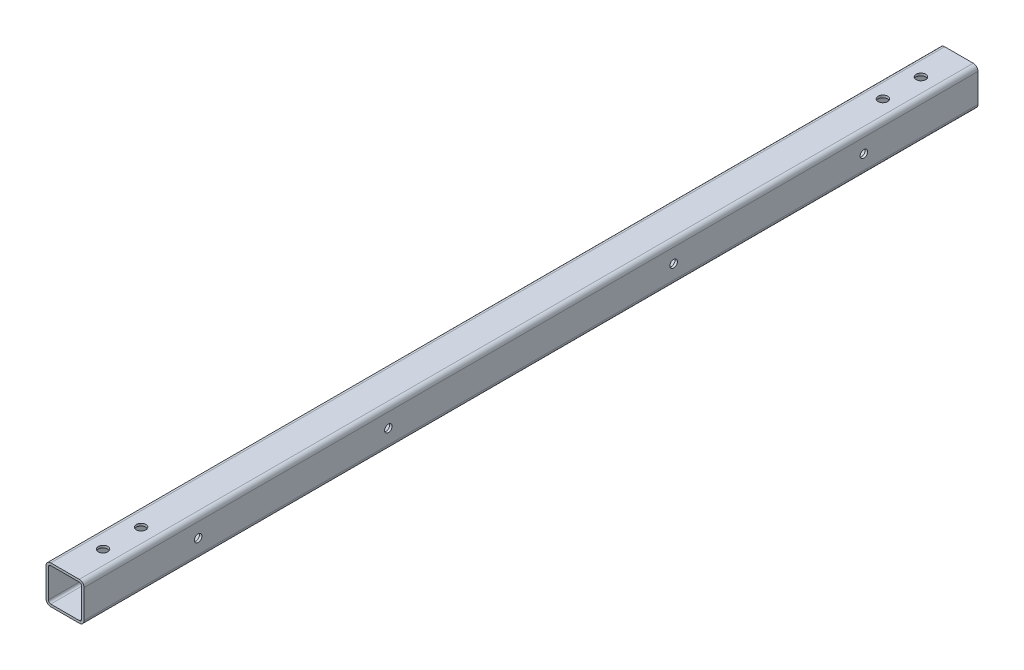
ISO-10303-21;
HEADER;
FILE_DESCRIPTION(('STEP AP214'),'2;1');
FILE_NAME('part.step','',(''),(''),'','','');
FILE_SCHEMA(('AUTOMOTIVE_DESIGN { 1 0 10303 214 1 1 1 1 }'));
ENDSEC;
DATA;
#1=APPLICATION_CONTEXT('core data for automotive mechanical design processes');
#2=APPLICATION_PROTOCOL_DEFINITION('international standard','automotive_design',2000,#1);
#3=PRODUCT_CONTEXT('',#1,'mechanical');
#4=PRODUCT('Part','Part','',(#3));
#5=PRODUCT_RELATED_PRODUCT_CATEGORY('part','',(#4));
#6=PRODUCT_DEFINITION_FORMATION('','',#4);
#7=PRODUCT_DEFINITION_CONTEXT('part definition',#1,'design');
#8=PRODUCT_DEFINITION('design','',#6,#7);
#9=PRODUCT_DEFINITION_SHAPE('','',#8);
#10=(LENGTH_UNIT() NAMED_UNIT(*) SI_UNIT(.MILLI.,.METRE.));
#11=(NAMED_UNIT(*) PLANE_ANGLE_UNIT() SI_UNIT($,.RADIAN.));
#12=(NAMED_UNIT(*) SI_UNIT($,.STERADIAN.) SOLID_ANGLE_UNIT());
#13=UNCERTAINTY_MEASURE_WITH_UNIT(LENGTH_MEASURE(1.E-05),#10,'distance_accuracy_value','');
#14=(GEOMETRIC_REPRESENTATION_CONTEXT(3) GLOBAL_UNCERTAINTY_ASSIGNED_CONTEXT((#13)) GLOBAL_UNIT_ASSIGNED_CONTEXT((#10,
#11,#12)) REPRESENTATION_CONTEXT('',''));
#15=CARTESIAN_POINT('',(0.,0.,0.));
#16=DIRECTION('',(0.,0.,1.));
#17=DIRECTION('',(1.,0.,0.));
#18=AXIS2_PLACEMENT_3D('',#15,#16,#17);
#19=CARTESIAN_POINT('',(-12.7,-12.7,-298.45));
#20=DIRECTION('',(0.,0.,-1.));
#21=DIRECTION('',(-1.,0.,0.));
#22=AXIS2_PLACEMENT_3D('',#19,#20,#21);
#23=PLANE('',#22);
#24=DIRECTION('',(0.,-1.,0.));
#25=VECTOR('',#24,1.);
#26=CARTESIAN_POINT('',(-12.7,12.7,-298.45));
#27=LINE('',#26,#25);
#28=CARTESIAN_POINT('',(-12.7,9.525,-298.45));
#29=VERTEX_POINT('',#28);
#30=CARTESIAN_POINT('',(-12.7,-9.525,-298.45));
#31=VERTEX_POINT('',#30);
#32=EDGE_CURVE('E239',#29,#31,#27,.T.);
#33=ORIENTED_EDGE('',*,*,#32,.F.);
#34=CARTESIAN_POINT('',(-9.525,9.525,-298.45));
#35=DIRECTION('',(0.,0.,-1.));
#36=DIRECTION('',(-1.,0.,0.));
#37=AXIS2_PLACEMENT_3D('',#34,#35,#36);
#38=CIRCLE('',#37,3.175);
#39=CARTESIAN_POINT('',(-9.525,12.7,-298.45));
#40=VERTEX_POINT('',#39);
#41=EDGE_CURVE('E265',#29,#40,#38,.T.);
#42=ORIENTED_EDGE('',*,*,#41,.T.);
#43=DIRECTION('',(1.,0.,0.));
#44=VECTOR('',#43,1.);
#45=CARTESIAN_POINT('',(-12.7,12.7,-298.45));
#46=LINE('',#45,#44);
#47=CARTESIAN_POINT('',(9.525,12.7,-298.45));
#48=VERTEX_POINT('',#47);
#49=EDGE_CURVE('E226',#40,#48,#46,.T.);
#50=ORIENTED_EDGE('',*,*,#49,.T.);
#51=CARTESIAN_POINT('',(9.525,9.525,-298.45));
#52=DIRECTION('',(0.,0.,-1.));
#53=DIRECTION('',(-1.,0.,0.));
#54=AXIS2_PLACEMENT_3D('',#51,#52,#53);
#55=CIRCLE('',#54,3.175);
#56=CARTESIAN_POINT('',(12.7,9.525,-298.45));
#57=VERTEX_POINT('',#56);
#58=EDGE_CURVE('E261',#48,#57,#55,.T.);
#59=ORIENTED_EDGE('',*,*,#58,.T.);
#60=DIRECTION('',(0.,1.,0.));
#61=VECTOR('',#60,1.);
#62=CARTESIAN_POINT('',(12.7,-12.7,-298.45));
#63=LINE('',#62,#61);
#64=CARTESIAN_POINT('',(12.7,-9.525,-298.45));
#65=VERTEX_POINT('',#64);
#66=EDGE_CURVE('E247',#65,#57,#63,.T.);
#67=ORIENTED_EDGE('',*,*,#66,.F.);
#68=CARTESIAN_POINT('',(9.525,-9.525,-298.45));
#69=DIRECTION('',(0.,0.,-1.));
#70=DIRECTION('',(-1.,0.,0.));
#71=AXIS2_PLACEMENT_3D('',#68,#69,#70);
#72=CIRCLE('',#71,3.175);
#73=CARTESIAN_POINT('',(9.525,-12.7,-298.45));
#74=VERTEX_POINT('',#73);
#75=EDGE_CURVE('E259',#65,#74,#72,.T.);
#76=ORIENTED_EDGE('',*,*,#75,.T.);
#77=DIRECTION('',(-1.,0.,0.));
#78=VECTOR('',#77,1.);
#79=CARTESIAN_POINT('',(12.7,-12.7,-298.45));
#80=LINE('',#79,#78);
#81=CARTESIAN_POINT('',(-9.52499999999999,-12.7,-298.45));
#82=VERTEX_POINT('',#81);
#83=EDGE_CURVE('E243',#74,#82,#80,.T.);
#84=ORIENTED_EDGE('',*,*,#83,.T.);
#85=CARTESIAN_POINT('',(-9.52499999999999,-9.525,-298.45));
#86=DIRECTION('',(0.,0.,-1.));
#87=DIRECTION('',(-1.,0.,0.));
#88=AXIS2_PLACEMENT_3D('',#85,#86,#87);
#89=CIRCLE('',#88,3.175);
#90=EDGE_CURVE('E263',#82,#31,#89,.T.);
#91=ORIENTED_EDGE('',*,*,#90,.T.);
#92=EDGE_LOOP('',(#33,#42,#50,#59,#67,#76,#84,#91));
#93=FACE_BOUND('',#92,.T.);
#94=CARTESIAN_POINT('',(-9.525,9.525,-298.45));
#95=DIRECTION('',(0.,0.,-1.));
#96=DIRECTION('',(-1.,0.,0.));
#97=AXIS2_PLACEMENT_3D('',#94,#95,#96);
#98=CIRCLE('',#97,1.5875);
#99=CARTESIAN_POINT('',(-11.1125,9.525,-298.45));
#100=VERTEX_POINT('',#99);
#101=CARTESIAN_POINT('',(-9.525,11.1125,-298.45));
#102=VERTEX_POINT('',#101);
#103=EDGE_CURVE('E207',#100,#102,#98,.T.);
#104=ORIENTED_EDGE('',*,*,#103,.F.);
#105=DIRECTION('',(0.,-1.,0.));
#106=VECTOR('',#105,1.);
#107=CARTESIAN_POINT('',(-11.1125,-12.7,-298.45));
#108=LINE('',#107,#106);
#109=CARTESIAN_POINT('',(-11.1125,-9.525,-298.45));
#110=VERTEX_POINT('',#109);
#111=EDGE_CURVE('E204',#100,#110,#108,.T.);
#112=ORIENTED_EDGE('',*,*,#111,.T.);
#113=CARTESIAN_POINT('',(-9.52499999999999,-9.525,-298.45));
#114=DIRECTION('',(0.,0.,-1.));
#115=DIRECTION('',(-1.,0.,0.));
#116=AXIS2_PLACEMENT_3D('',#113,#114,#115);
#117=CIRCLE('',#116,1.5875);
#118=CARTESIAN_POINT('',(-9.52499999999999,-11.1125,-298.45));
#119=VERTEX_POINT('',#118);
#120=EDGE_CURVE('E165',#119,#110,#117,.T.);
#121=ORIENTED_EDGE('',*,*,#120,.F.);
#122=DIRECTION('',(-1.,0.,0.));
#123=VECTOR('',#122,1.);
#124=CARTESIAN_POINT('',(-12.7,-11.1125,-298.45));
#125=LINE('',#124,#123);
#126=CARTESIAN_POINT('',(9.525,-11.1125,-298.45));
#127=VERTEX_POINT('',#126);
#128=EDGE_CURVE('E67',#127,#119,#125,.T.);
#129=ORIENTED_EDGE('',*,*,#128,.F.);
#130=CARTESIAN_POINT('',(9.525,-9.525,-298.45));
#131=DIRECTION('',(0.,0.,-1.));
#132=DIRECTION('',(-1.,0.,0.));
#133=AXIS2_PLACEMENT_3D('',#130,#131,#132);
#134=CIRCLE('',#133,1.5875);
#135=CARTESIAN_POINT('',(11.1125,-9.525,-298.45));
#136=VERTEX_POINT('',#135);
#137=EDGE_CURVE('E215',#136,#127,#134,.T.);
#138=ORIENTED_EDGE('',*,*,#137,.F.);
#139=DIRECTION('',(0.,1.,0.));
#140=VECTOR('',#139,1.);
#141=CARTESIAN_POINT('',(11.1125,-12.7,-298.45));
#142=LINE('',#141,#140);
#143=CARTESIAN_POINT('',(11.1125,9.525,-298.45));
#144=VERTEX_POINT('',#143);
#145=EDGE_CURVE('E212',#136,#144,#142,.T.);
#146=ORIENTED_EDGE('',*,*,#145,.T.);
#147=CARTESIAN_POINT('',(9.525,9.525,-298.45));
#148=DIRECTION('',(0.,0.,-1.));
#149=DIRECTION('',(-1.,0.,0.));
#150=AXIS2_PLACEMENT_3D('',#147,#148,#149);
#151=CIRCLE('',#150,1.5875);
#152=CARTESIAN_POINT('',(9.525,11.1125,-298.45));
#153=VERTEX_POINT('',#152);
#154=EDGE_CURVE('E213',#153,#144,#151,.T.);
#155=ORIENTED_EDGE('',*,*,#154,.F.);
#156=DIRECTION('',(1.,0.,0.));
#157=VECTOR('',#156,1.);
#158=CARTESIAN_POINT('',(-12.7,11.1125,-298.45));
#159=LINE('',#158,#157);
#160=EDGE_CURVE('E180',#102,#153,#159,.T.);
#161=ORIENTED_EDGE('',*,*,#160,.F.);
#162=EDGE_LOOP('',(#104,#112,#121,#129,#138,#146,#155,#161));
#163=FACE_BOUND('',#162,.T.);
#164=ADVANCED_FACE('F41',(#93,#163),#23,.T.);
#165=CARTESIAN_POINT('',(-12.7,12.7,298.45));
#166=DIRECTION('',(1.,0.,0.));
#167=DIRECTION('',(0.,1.,0.));
#168=AXIS2_PLACEMENT_3D('',#165,#166,#167);
#169=PLANE('',#168);
#170=DIRECTION('',(0.,-1.,0.));
#171=VECTOR('',#170,1.);
#172=CARTESIAN_POINT('',(-12.7,12.7,298.45));
#173=LINE('',#172,#171);
#174=CARTESIAN_POINT('',(-12.7,9.525,298.45));
#175=VERTEX_POINT('',#174);
#176=CARTESIAN_POINT('',(-12.7,-9.525,298.45));
#177=VERTEX_POINT('',#176);
#178=EDGE_CURVE('E222',#175,#177,#173,.T.);
#179=ORIENTED_EDGE('',*,*,#178,.F.);
#180=DIRECTION('',(0.,0.,-1.));
#181=VECTOR('',#180,1.);
#182=CARTESIAN_POINT('',(-12.7,9.525,-298.45));
#183=LINE('',#182,#181);
#184=EDGE_CURVE('E255',#175,#29,#183,.T.);
#185=ORIENTED_EDGE('',*,*,#184,.T.);
#186=ORIENTED_EDGE('',*,*,#32,.T.);
#187=DIRECTION('',(0.,0.,-1.));
#188=VECTOR('',#187,1.);
#189=CARTESIAN_POINT('',(-12.7,-9.525,298.45));
#190=LINE('',#189,#188);
#191=EDGE_CURVE('E238',#31,#177,#190,.F.);
#192=ORIENTED_EDGE('',*,*,#191,.T.);
#193=EDGE_LOOP('',(#179,#185,#186,#192));
#194=FACE_BOUND('',#193,.T.);
#195=ADVANCED_FACE('F384',(#194),#169,.F.);
#196=CARTESIAN_POINT('',(12.7,-12.7,298.45));
#197=DIRECTION('',(0.,-1.,0.));
#198=DIRECTION('',(1.,0.,0.));
#199=AXIS2_PLACEMENT_3D('',#196,#197,#198);
#200=PLANE('',#199);
#201=CARTESIAN_POINT('',(0.,-12.7,-273.05));
#202=DIRECTION('',(0.,-1.,0.));
#203=DIRECTION('',(1.,0.,0.));
#204=AXIS2_PLACEMENT_3D('',#201,#202,#203);
#205=CIRCLE('',#204,3.175);
#206=CARTESIAN_POINT('',(3.17500000000005,-12.7,-273.05));
#207=VERTEX_POINT('',#206);
#208=EDGE_CURVE('E659',#207,#207,#205,.T.);
#209=ORIENTED_EDGE('',*,*,#208,.F.);
#210=EDGE_LOOP('',(#209));
#211=FACE_BOUND('',#210,.T.);
#212=CARTESIAN_POINT('',(0.,-12.7,-247.65));
#213=DIRECTION('',(0.,-1.,0.));
#214=DIRECTION('',(1.,0.,0.));
#215=AXIS2_PLACEMENT_3D('',#212,#213,#214);
#216=CIRCLE('',#215,3.175);
#217=CARTESIAN_POINT('',(3.17500000000005,-12.7,-247.65));
#218=VERTEX_POINT('',#217);
#219=EDGE_CURVE('E310',#218,#218,#216,.T.);
#220=ORIENTED_EDGE('',*,*,#219,.F.);
#221=EDGE_LOOP('',(#220));
#222=FACE_BOUND('',#221,.T.);
#223=CARTESIAN_POINT('',(0.,-12.7,247.65));
#224=DIRECTION('',(0.,-1.,0.));
#225=DIRECTION('',(1.,0.,0.));
#226=AXIS2_PLACEMENT_3D('',#223,#224,#225);
#227=CIRCLE('',#226,3.175);
#228=CARTESIAN_POINT('',(3.17499999999998,-12.7,247.65));
#229=VERTEX_POINT('',#228);
#230=EDGE_CURVE('E307',#229,#229,#227,.T.);
#231=ORIENTED_EDGE('',*,*,#230,.F.);
#232=EDGE_LOOP('',(#231));
#233=FACE_BOUND('',#232,.T.);
#234=CARTESIAN_POINT('',(0.,-12.7,273.05));
#235=DIRECTION('',(0.,-1.,0.));
#236=DIRECTION('',(1.,0.,0.));
#237=AXIS2_PLACEMENT_3D('',#234,#235,#236);
#238=CIRCLE('',#237,3.17499999999999);
#239=CARTESIAN_POINT('',(3.17499999999997,-12.7,273.05));
#240=VERTEX_POINT('',#239);
#241=EDGE_CURVE('E326',#240,#240,#238,.T.);
#242=ORIENTED_EDGE('',*,*,#241,.F.);
#243=EDGE_LOOP('',(#242));
#244=FACE_BOUND('',#243,.T.);
#245=DIRECTION('',(-1.,0.,0.));
#246=VECTOR('',#245,1.);
#247=CARTESIAN_POINT('',(12.7,-12.7,298.45));
#248=LINE('',#247,#246);
#249=CARTESIAN_POINT('',(9.525,-12.7,298.45));
#250=VERTEX_POINT('',#249);
#251=CARTESIAN_POINT('',(-9.52499999999999,-12.7,298.45));
#252=VERTEX_POINT('',#251);
#253=EDGE_CURVE('E225',#250,#252,#248,.T.);
#254=ORIENTED_EDGE('',*,*,#253,.T.);
#255=DIRECTION('',(0.,0.,-1.));
#256=VECTOR('',#255,1.);
#257=CARTESIAN_POINT('',(-9.52499999999999,-12.7,-298.45));
#258=LINE('',#257,#256);
#259=EDGE_CURVE('E285',#252,#82,#258,.T.);
#260=ORIENTED_EDGE('',*,*,#259,.T.);
#261=ORIENTED_EDGE('',*,*,#83,.F.);
#262=DIRECTION('',(0.,0.,-1.));
#263=VECTOR('',#262,1.);
#264=CARTESIAN_POINT('',(9.525,-12.7,298.45));
#265=LINE('',#264,#263);
#266=EDGE_CURVE('E282',#74,#250,#265,.F.);
#267=ORIENTED_EDGE('',*,*,#266,.T.);
#268=EDGE_LOOP('',(#254,#260,#261,#267));
#269=FACE_BOUND('',#268,.T.);
#270=ADVANCED_FACE('F390',(#211,#222,#233,#244,#269),#200,.T.);
#271=CARTESIAN_POINT('',(12.7,-12.7,298.45));
#272=DIRECTION('',(-1.,0.,0.));
#273=DIRECTION('',(0.,0.,1.));
#274=AXIS2_PLACEMENT_3D('',#271,#272,#273);
#275=PLANE('',#274);
#276=CARTESIAN_POINT('',(12.7,0.,95.2500000000002));
#277=DIRECTION('',(-1.,0.,0.));
#278=DIRECTION('',(0.,0.,1.));
#279=AXIS2_PLACEMENT_3D('',#276,#277,#278);
#280=CIRCLE('',#279,2.49999999999999);
#281=CARTESIAN_POINT('',(12.7,0.,97.7500000000002));
#282=VERTEX_POINT('',#281);
#283=EDGE_CURVE('E681',#282,#282,#280,.F.);
#284=ORIENTED_EDGE('',*,*,#283,.F.);
#285=EDGE_LOOP('',(#284));
#286=FACE_BOUND('',#285,.T.);
#287=CARTESIAN_POINT('',(12.7,0.,222.25));
#288=DIRECTION('',(-1.,0.,0.));
#289=DIRECTION('',(0.,0.,1.));
#290=AXIS2_PLACEMENT_3D('',#287,#288,#289);
#291=CIRCLE('',#290,2.49999999999999);
#292=CARTESIAN_POINT('',(12.7,0.,224.75));
#293=VERTEX_POINT('',#292);
#294=EDGE_CURVE('E675',#293,#293,#291,.F.);
#295=ORIENTED_EDGE('',*,*,#294,.F.);
#296=EDGE_LOOP('',(#295));
#297=FACE_BOUND('',#296,.T.);
#298=CARTESIAN_POINT('',(12.7,0.,-222.25));
#299=DIRECTION('',(-1.,0.,0.));
#300=DIRECTION('',(0.,0.,1.));
#301=AXIS2_PLACEMENT_3D('',#298,#299,#300);
#302=CIRCLE('',#301,2.49999999999999);
#303=CARTESIAN_POINT('',(12.7,0.,-219.75));
#304=VERTEX_POINT('',#303);
#305=EDGE_CURVE('E669',#304,#304,#302,.F.);
#306=ORIENTED_EDGE('',*,*,#305,.F.);
#307=EDGE_LOOP('',(#306));
#308=FACE_BOUND('',#307,.T.);
#309=CARTESIAN_POINT('',(12.7,0.,-95.2499999999998));
#310=DIRECTION('',(-1.,0.,0.));
#311=DIRECTION('',(0.,0.,1.));
#312=AXIS2_PLACEMENT_3D('',#309,#310,#311);
#313=CIRCLE('',#312,2.49999999999999);
#314=CARTESIAN_POINT('',(12.7,0.,-92.7499999999998));
#315=VERTEX_POINT('',#314);
#316=EDGE_CURVE('E662',#315,#315,#313,.F.);
#317=ORIENTED_EDGE('',*,*,#316,.F.);
#318=EDGE_LOOP('',(#317));
#319=FACE_BOUND('',#318,.T.);
#320=ORIENTED_EDGE('',*,*,#66,.T.);
#321=DIRECTION('',(0.,0.,-1.));
#322=VECTOR('',#321,1.);
#323=CARTESIAN_POINT('',(12.7,9.525,298.45));
#324=LINE('',#323,#322);
#325=CARTESIAN_POINT('',(12.7,9.525,298.45));
#326=VERTEX_POINT('',#325);
#327=EDGE_CURVE('E11',#57,#326,#324,.F.);
#328=ORIENTED_EDGE('',*,*,#327,.T.);
#329=DIRECTION('',(0.,1.,0.));
#330=VECTOR('',#329,1.);
#331=CARTESIAN_POINT('',(12.7,-12.7,298.45));
#332=LINE('',#331,#330);
#333=CARTESIAN_POINT('',(12.7,-9.525,298.45));
#334=VERTEX_POINT('',#333);
#335=EDGE_CURVE('E230',#334,#326,#332,.T.);
#336=ORIENTED_EDGE('',*,*,#335,.F.);
#337=DIRECTION('',(0.,0.,-1.));
#338=VECTOR('',#337,1.);
#339=CARTESIAN_POINT('',(12.7,-9.525,-298.45));
#340=LINE('',#339,#338);
#341=EDGE_CURVE('E51',#334,#65,#340,.T.);
#342=ORIENTED_EDGE('',*,*,#341,.T.);
#343=EDGE_LOOP('',(#320,#328,#336,#342));
#344=FACE_BOUND('',#343,.T.);
#345=ADVANCED_FACE('F400',(#286,#297,#308,#319,#344),#275,.F.);
#346=CARTESIAN_POINT('',(-12.7,12.7,298.45));
#347=DIRECTION('',(0.,1.,0.));
#348=DIRECTION('',(-1.,0.,0.));
#349=AXIS2_PLACEMENT_3D('',#346,#347,#348);
#350=PLANE('',#349);
#351=CARTESIAN_POINT('',(0.,12.7,-273.05));
#352=DIRECTION('',(0.,-1.,0.));
#353=DIRECTION('',(1.,0.,0.));
#354=AXIS2_PLACEMENT_3D('',#351,#352,#353);
#355=CIRCLE('',#354,3.175);
#356=CARTESIAN_POINT('',(3.17500000000005,12.7,-273.05));
#357=VERTEX_POINT('',#356);
#358=EDGE_CURVE('E657',#357,#357,#355,.T.);
#359=ORIENTED_EDGE('',*,*,#358,.T.);
#360=EDGE_LOOP('',(#359));
#361=FACE_BOUND('',#360,.T.);
#362=CARTESIAN_POINT('',(0.,12.7,-247.65));
#363=DIRECTION('',(0.,-1.,0.));
#364=DIRECTION('',(1.,0.,0.));
#365=AXIS2_PLACEMENT_3D('',#362,#363,#364);
#366=CIRCLE('',#365,3.175);
#367=CARTESIAN_POINT('',(3.17500000000005,12.7,-247.65));
#368=VERTEX_POINT('',#367);
#369=EDGE_CURVE('E303',#368,#368,#366,.T.);
#370=ORIENTED_EDGE('',*,*,#369,.T.);
#371=EDGE_LOOP('',(#370));
#372=FACE_BOUND('',#371,.T.);
#373=CARTESIAN_POINT('',(0.,12.7,247.65));
#374=DIRECTION('',(0.,-1.,0.));
#375=DIRECTION('',(1.,0.,0.));
#376=AXIS2_PLACEMENT_3D('',#373,#374,#375);
#377=CIRCLE('',#376,3.175);
#378=CARTESIAN_POINT('',(3.17499999999999,12.7,247.65));
#379=VERTEX_POINT('',#378);
#380=EDGE_CURVE('E299',#379,#379,#377,.T.);
#381=ORIENTED_EDGE('',*,*,#380,.T.);
#382=EDGE_LOOP('',(#381));
#383=FACE_BOUND('',#382,.T.);
#384=CARTESIAN_POINT('',(0.,12.7,273.05));
#385=DIRECTION('',(0.,-1.,0.));
#386=DIRECTION('',(1.,0.,0.));
#387=AXIS2_PLACEMENT_3D('',#384,#385,#386);
#388=CIRCLE('',#387,3.17499999999999);
#389=CARTESIAN_POINT('',(3.17499999999997,12.7,273.05));
#390=VERTEX_POINT('',#389);
#391=EDGE_CURVE('E295',#390,#390,#388,.T.);
#392=ORIENTED_EDGE('',*,*,#391,.T.);
#393=EDGE_LOOP('',(#392));
#394=FACE_BOUND('',#393,.T.);
#395=ORIENTED_EDGE('',*,*,#49,.F.);
#396=DIRECTION('',(0.,0.,-1.));
#397=VECTOR('',#396,1.);
#398=CARTESIAN_POINT('',(-9.525,12.7,298.45));
#399=LINE('',#398,#397);
#400=CARTESIAN_POINT('',(-9.525,12.7,298.45));
#401=VERTEX_POINT('',#400);
#402=EDGE_CURVE('E271',#40,#401,#399,.F.);
#403=ORIENTED_EDGE('',*,*,#402,.T.);
#404=DIRECTION('',(1.,0.,0.));
#405=VECTOR('',#404,1.);
#406=CARTESIAN_POINT('',(-12.7,12.7,298.45));
#407=LINE('',#406,#405);
#408=CARTESIAN_POINT('',(9.525,12.7,298.45));
#409=VERTEX_POINT('',#408);
#410=EDGE_CURVE('E234',#401,#409,#407,.T.);
#411=ORIENTED_EDGE('',*,*,#410,.T.);
#412=DIRECTION('',(0.,0.,-1.));
#413=VECTOR('',#412,1.);
#414=CARTESIAN_POINT('',(9.525,12.7,-298.45));
#415=LINE('',#414,#413);
#416=EDGE_CURVE('E267',#409,#48,#415,.T.);
#417=ORIENTED_EDGE('',*,*,#416,.T.);
#418=EDGE_LOOP('',(#395,#403,#411,#417));
#419=FACE_BOUND('',#418,.T.);
#420=ADVANCED_FACE('F397',(#361,#372,#383,#394,#419),#350,.T.);
#421=CARTESIAN_POINT('',(-12.7,-12.7,298.45));
#422=DIRECTION('',(0.,0.,-1.));
#423=DIRECTION('',(-1.,0.,0.));
#424=AXIS2_PLACEMENT_3D('',#421,#422,#423);
#425=PLANE('',#424);
#426=CARTESIAN_POINT('',(-9.525,9.525,298.45));
#427=DIRECTION('',(0.,0.,-1.));
#428=DIRECTION('',(-1.,0.,0.));
#429=AXIS2_PLACEMENT_3D('',#426,#427,#428);
#430=CIRCLE('',#429,1.5875);
#431=CARTESIAN_POINT('',(-9.525,11.1125,298.45));
#432=VERTEX_POINT('',#431);
#433=CARTESIAN_POINT('',(-11.1125,9.525,298.45));
#434=VERTEX_POINT('',#433);
#435=EDGE_CURVE('E187',#432,#434,#430,.F.);
#436=ORIENTED_EDGE('',*,*,#435,.F.);
#437=DIRECTION('',(1.,0.,0.));
#438=VECTOR('',#437,1.);
#439=CARTESIAN_POINT('',(-12.7,11.1125,298.45));
#440=LINE('',#439,#438);
#441=CARTESIAN_POINT('',(9.525,11.1125,298.45));
#442=VERTEX_POINT('',#441);
#443=EDGE_CURVE('E171',#432,#442,#440,.T.);
#444=ORIENTED_EDGE('',*,*,#443,.T.);
#445=CARTESIAN_POINT('',(9.525,9.525,298.45));
#446=DIRECTION('',(0.,0.,-1.));
#447=DIRECTION('',(-1.,0.,0.));
#448=AXIS2_PLACEMENT_3D('',#445,#446,#447);
#449=CIRCLE('',#448,1.5875);
#450=CARTESIAN_POINT('',(11.1125,9.525,298.45));
#451=VERTEX_POINT('',#450);
#452=EDGE_CURVE('E188',#451,#442,#449,.F.);
#453=ORIENTED_EDGE('',*,*,#452,.F.);
#454=DIRECTION('',(0.,1.,0.));
#455=VECTOR('',#454,1.);
#456=CARTESIAN_POINT('',(11.1125,-12.7,298.45));
#457=LINE('',#456,#455);
#458=CARTESIAN_POINT('',(11.1125,-9.525,298.45));
#459=VERTEX_POINT('',#458);
#460=EDGE_CURVE('E59',#459,#451,#457,.T.);
#461=ORIENTED_EDGE('',*,*,#460,.F.);
#462=CARTESIAN_POINT('',(9.525,-9.525,298.45));
#463=DIRECTION('',(0.,0.,-1.));
#464=DIRECTION('',(-1.,0.,0.));
#465=AXIS2_PLACEMENT_3D('',#462,#463,#464);
#466=CIRCLE('',#465,1.5875);
#467=CARTESIAN_POINT('',(9.525,-11.1125,298.45));
#468=VERTEX_POINT('',#467);
#469=EDGE_CURVE('E192',#468,#459,#466,.F.);
#470=ORIENTED_EDGE('',*,*,#469,.F.);
#471=DIRECTION('',(-1.,0.,0.));
#472=VECTOR('',#471,1.);
#473=CARTESIAN_POINT('',(-12.7,-11.1125,298.45));
#474=LINE('',#473,#472);
#475=CARTESIAN_POINT('',(-9.52499999999999,-11.1125,298.45));
#476=VERTEX_POINT('',#475);
#477=EDGE_CURVE('E179',#468,#476,#474,.T.);
#478=ORIENTED_EDGE('',*,*,#477,.T.);
#479=CARTESIAN_POINT('',(-9.52499999999999,-9.525,298.45));
#480=DIRECTION('',(0.,0.,-1.));
#481=DIRECTION('',(-1.,0.,0.));
#482=AXIS2_PLACEMENT_3D('',#479,#480,#481);
#483=CIRCLE('',#482,1.5875);
#484=CARTESIAN_POINT('',(-11.1125,-9.525,298.45));
#485=VERTEX_POINT('',#484);
#486=EDGE_CURVE('E163',#485,#476,#483,.F.);
#487=ORIENTED_EDGE('',*,*,#486,.F.);
#488=DIRECTION('',(0.,-1.,0.));
#489=VECTOR('',#488,1.);
#490=CARTESIAN_POINT('',(-11.1125,-12.7,298.45));
#491=LINE('',#490,#489);
#492=EDGE_CURVE('E175',#434,#485,#491,.T.);
#493=ORIENTED_EDGE('',*,*,#492,.F.);
#494=EDGE_LOOP('',(#436,#444,#453,#461,#470,#478,#487,#493));
#495=FACE_BOUND('',#494,.T.);
#496=ORIENTED_EDGE('',*,*,#410,.F.);
#497=CARTESIAN_POINT('',(-9.525,9.525,298.45));
#498=DIRECTION('',(0.,0.,-1.));
#499=DIRECTION('',(-1.,0.,0.));
#500=AXIS2_PLACEMENT_3D('',#497,#498,#499);
#501=CIRCLE('',#500,3.175);
#502=EDGE_CURVE('E280',#401,#175,#501,.F.);
#503=ORIENTED_EDGE('',*,*,#502,.T.);
#504=ORIENTED_EDGE('',*,*,#178,.T.);
#505=CARTESIAN_POINT('',(-9.52499999999999,-9.525,298.45));
#506=DIRECTION('',(0.,0.,-1.));
#507=DIRECTION('',(-1.,0.,0.));
#508=AXIS2_PLACEMENT_3D('',#505,#506,#507);
#509=CIRCLE('',#508,3.175);
#510=EDGE_CURVE('E278',#177,#252,#509,.F.);
#511=ORIENTED_EDGE('',*,*,#510,.T.);
#512=ORIENTED_EDGE('',*,*,#253,.F.);
#513=CARTESIAN_POINT('',(9.525,-9.525,298.45));
#514=DIRECTION('',(0.,0.,-1.));
#515=DIRECTION('',(-1.,0.,0.));
#516=AXIS2_PLACEMENT_3D('',#513,#514,#515);
#517=CIRCLE('',#516,3.175);
#518=EDGE_CURVE('E274',#250,#334,#517,.F.);
#519=ORIENTED_EDGE('',*,*,#518,.T.);
#520=ORIENTED_EDGE('',*,*,#335,.T.);
#521=CARTESIAN_POINT('',(9.525,9.525,298.45));
#522=DIRECTION('',(0.,0.,-1.));
#523=DIRECTION('',(-1.,0.,0.));
#524=AXIS2_PLACEMENT_3D('',#521,#522,#523);
#525=CIRCLE('',#524,3.175);
#526=EDGE_CURVE('E276',#326,#409,#525,.F.);
#527=ORIENTED_EDGE('',*,*,#526,.T.);
#528=EDGE_LOOP('',(#496,#503,#504,#511,#512,#519,#520,#527));
#529=FACE_BOUND('',#528,.T.);
#530=ADVANCED_FACE('F183',(#495,#529),#425,.F.);
#531=CARTESIAN_POINT('',(-9.525,9.525,298.45));
#532=DIRECTION('',(0.,0.,1.));
#533=DIRECTION('',(1.,0.,0.));
#534=AXIS2_PLACEMENT_3D('',#531,#532,#533);
#535=CYLINDRICAL_SURFACE('',#534,3.175);
#536=ORIENTED_EDGE('',*,*,#502,.F.);
#537=ORIENTED_EDGE('',*,*,#402,.F.);
#538=ORIENTED_EDGE('',*,*,#41,.F.);
#539=ORIENTED_EDGE('',*,*,#184,.F.);
#540=EDGE_LOOP('',(#536,#537,#538,#539));
#541=FACE_BOUND('',#540,.T.);
#542=ADVANCED_FACE('F407',(#541),#535,.T.);
#543=CARTESIAN_POINT('',(-9.52499999999999,-9.525,298.45));
#544=DIRECTION('',(0.,0.,1.));
#545=DIRECTION('',(1.,0.,0.));
#546=AXIS2_PLACEMENT_3D('',#543,#544,#545);
#547=CYLINDRICAL_SURFACE('',#546,3.175);
#548=ORIENTED_EDGE('',*,*,#510,.F.);
#549=ORIENTED_EDGE('',*,*,#191,.F.);
#550=ORIENTED_EDGE('',*,*,#90,.F.);
#551=ORIENTED_EDGE('',*,*,#259,.F.);
#552=EDGE_LOOP('',(#548,#549,#550,#551));
#553=FACE_BOUND('',#552,.T.);
#554=ADVANCED_FACE('F410',(#553),#547,.T.);
#555=CARTESIAN_POINT('',(9.525,9.525,298.45));
#556=DIRECTION('',(0.,0.,1.));
#557=DIRECTION('',(1.,0.,0.));
#558=AXIS2_PLACEMENT_3D('',#555,#556,#557);
#559=CYLINDRICAL_SURFACE('',#558,3.175);
#560=ORIENTED_EDGE('',*,*,#526,.F.);
#561=ORIENTED_EDGE('',*,*,#327,.F.);
#562=ORIENTED_EDGE('',*,*,#58,.F.);
#563=ORIENTED_EDGE('',*,*,#416,.F.);
#564=EDGE_LOOP('',(#560,#561,#562,#563));
#565=FACE_BOUND('',#564,.T.);
#566=ADVANCED_FACE('F413',(#565),#559,.T.);
#567=CARTESIAN_POINT('',(9.525,-9.525,298.45));
#568=DIRECTION('',(0.,0.,1.));
#569=DIRECTION('',(1.,0.,0.));
#570=AXIS2_PLACEMENT_3D('',#567,#568,#569);
#571=CYLINDRICAL_SURFACE('',#570,3.175);
#572=ORIENTED_EDGE('',*,*,#518,.F.);
#573=ORIENTED_EDGE('',*,*,#266,.F.);
#574=ORIENTED_EDGE('',*,*,#75,.F.);
#575=ORIENTED_EDGE('',*,*,#341,.F.);
#576=EDGE_LOOP('',(#572,#573,#574,#575));
#577=FACE_BOUND('',#576,.T.);
#578=ADVANCED_FACE('F43',(#577),#571,.T.);
#579=CARTESIAN_POINT('',(-11.1125,12.7,298.45));
#580=DIRECTION('',(1.,0.,0.));
#581=DIRECTION('',(0.,1.,0.));
#582=AXIS2_PLACEMENT_3D('',#579,#580,#581);
#583=PLANE('',#582);
#584=ORIENTED_EDGE('',*,*,#492,.T.);
#585=DIRECTION('',(0.,0.,1.));
#586=VECTOR('',#585,1.);
#587=CARTESIAN_POINT('',(-11.1125,-9.525,298.45));
#588=LINE('',#587,#586);
#589=EDGE_CURVE('E159',#110,#485,#588,.T.);
#590=ORIENTED_EDGE('',*,*,#589,.F.);
#591=ORIENTED_EDGE('',*,*,#111,.F.);
#592=DIRECTION('',(0.,0.,1.));
#593=VECTOR('',#592,1.);
#594=CARTESIAN_POINT('',(-11.1125,9.525,298.45));
#595=LINE('',#594,#593);
#596=EDGE_CURVE('E170',#434,#100,#595,.F.);
#597=ORIENTED_EDGE('',*,*,#596,.F.);
#598=EDGE_LOOP('',(#584,#590,#591,#597));
#599=FACE_BOUND('',#598,.T.);
#600=ADVANCED_FACE('F176',(#599),#583,.T.);
#601=CARTESIAN_POINT('',(12.7,-11.1125,298.45));
#602=DIRECTION('',(0.,-1.,0.));
#603=DIRECTION('',(1.,0.,0.));
#604=AXIS2_PLACEMENT_3D('',#601,#602,#603);
#605=PLANE('',#604);
#606=CARTESIAN_POINT('',(0.,-11.1125,-273.05));
#607=DIRECTION('',(0.,-1.,0.));
#608=DIRECTION('',(1.,0.,0.));
#609=AXIS2_PLACEMENT_3D('',#606,#607,#608);
#610=CIRCLE('',#609,3.175);
#611=CARTESIAN_POINT('',(3.17500000000005,-11.1125,-273.05));
#612=VERTEX_POINT('',#611);
#613=EDGE_CURVE('E315',#612,#612,#610,.T.);
#614=ORIENTED_EDGE('',*,*,#613,.T.);
#615=EDGE_LOOP('',(#614));
#616=FACE_BOUND('',#615,.T.);
#617=CARTESIAN_POINT('',(0.,-11.1125,-247.65));
#618=DIRECTION('',(0.,-1.,0.));
#619=DIRECTION('',(1.,0.,0.));
#620=AXIS2_PLACEMENT_3D('',#617,#618,#619);
#621=CIRCLE('',#620,3.175);
#622=CARTESIAN_POINT('',(3.17500000000005,-11.1125,-247.65));
#623=VERTEX_POINT('',#622);
#624=EDGE_CURVE('E302',#623,#623,#621,.T.);
#625=ORIENTED_EDGE('',*,*,#624,.T.);
#626=EDGE_LOOP('',(#625));
#627=FACE_BOUND('',#626,.T.);
#628=CARTESIAN_POINT('',(0.,-11.1125,247.65));
#629=DIRECTION('',(0.,-1.,0.));
#630=DIRECTION('',(1.,0.,0.));
#631=AXIS2_PLACEMENT_3D('',#628,#629,#630);
#632=CIRCLE('',#631,3.175);
#633=CARTESIAN_POINT('',(3.17499999999998,-11.1125,247.65));
#634=VERTEX_POINT('',#633);
#635=EDGE_CURVE('E298',#634,#634,#632,.T.);
#636=ORIENTED_EDGE('',*,*,#635,.T.);
#637=EDGE_LOOP('',(#636));
#638=FACE_BOUND('',#637,.T.);
#639=CARTESIAN_POINT('',(0.,-11.1125,273.05));
#640=DIRECTION('',(0.,-1.,0.));
#641=DIRECTION('',(1.,0.,0.));
#642=AXIS2_PLACEMENT_3D('',#639,#640,#641);
#643=CIRCLE('',#642,3.17499999999999);
#644=CARTESIAN_POINT('',(3.17499999999997,-11.1125,273.05));
#645=VERTEX_POINT('',#644);
#646=EDGE_CURVE('E206',#645,#645,#643,.T.);
#647=ORIENTED_EDGE('',*,*,#646,.T.);
#648=EDGE_LOOP('',(#647));
#649=FACE_BOUND('',#648,.T.);
#650=ORIENTED_EDGE('',*,*,#477,.F.);
#651=DIRECTION('',(0.,0.,1.));
#652=VECTOR('',#651,1.);
#653=CARTESIAN_POINT('',(9.525,-11.1125,298.45));
#654=LINE('',#653,#652);
#655=EDGE_CURVE('E190',#127,#468,#654,.T.);
#656=ORIENTED_EDGE('',*,*,#655,.F.);
#657=ORIENTED_EDGE('',*,*,#128,.T.);
#658=DIRECTION('',(0.,0.,1.));
#659=VECTOR('',#658,1.);
#660=CARTESIAN_POINT('',(-9.52499999999999,-11.1125,298.45));
#661=LINE('',#660,#659);
#662=EDGE_CURVE('E344',#476,#119,#661,.F.);
#663=ORIENTED_EDGE('',*,*,#662,.F.);
#664=EDGE_LOOP('',(#650,#656,#657,#663));
#665=FACE_BOUND('',#664,.T.);
#666=ADVANCED_FACE('F369',(#616,#627,#638,#649,#665),#605,.F.);
#667=CARTESIAN_POINT('',(11.1125,-12.7,298.45));
#668=DIRECTION('',(-1.,0.,0.));
#669=DIRECTION('',(0.,0.,1.));
#670=AXIS2_PLACEMENT_3D('',#667,#668,#669);
#671=PLANE('',#670);
#672=CARTESIAN_POINT('',(11.1125,0.,95.2500000000002));
#673=DIRECTION('',(-1.,0.,0.));
#674=DIRECTION('',(0.,0.,1.));
#675=AXIS2_PLACEMENT_3D('',#672,#673,#674);
#676=CIRCLE('',#675,2.49999999999999);
#677=CARTESIAN_POINT('',(11.1125,0.,97.7500000000002));
#678=VERTEX_POINT('',#677);
#679=EDGE_CURVE('E684',#678,#678,#676,.T.);
#680=ORIENTED_EDGE('',*,*,#679,.F.);
#681=EDGE_LOOP('',(#680));
#682=FACE_BOUND('',#681,.T.);
#683=CARTESIAN_POINT('',(11.1125,0.,222.25));
#684=DIRECTION('',(-1.,0.,0.));
#685=DIRECTION('',(0.,0.,1.));
#686=AXIS2_PLACEMENT_3D('',#683,#684,#685);
#687=CIRCLE('',#686,2.49999999999999);
#688=CARTESIAN_POINT('',(11.1125,0.,224.75));
#689=VERTEX_POINT('',#688);
#690=EDGE_CURVE('E678',#689,#689,#687,.T.);
#691=ORIENTED_EDGE('',*,*,#690,.F.);
#692=EDGE_LOOP('',(#691));
#693=FACE_BOUND('',#692,.T.);
#694=CARTESIAN_POINT('',(11.1125,0.,-222.25));
#695=DIRECTION('',(-1.,0.,0.));
#696=DIRECTION('',(0.,0.,1.));
#697=AXIS2_PLACEMENT_3D('',#694,#695,#696);
#698=CIRCLE('',#697,2.49999999999999);
#699=CARTESIAN_POINT('',(11.1125,0.,-219.75));
#700=VERTEX_POINT('',#699);
#701=EDGE_CURVE('E672',#700,#700,#698,.T.);
#702=ORIENTED_EDGE('',*,*,#701,.F.);
#703=EDGE_LOOP('',(#702));
#704=FACE_BOUND('',#703,.T.);
#705=CARTESIAN_POINT('',(11.1125,0.,-95.2499999999998));
#706=DIRECTION('',(-1.,0.,0.));
#707=DIRECTION('',(0.,0.,1.));
#708=AXIS2_PLACEMENT_3D('',#705,#706,#707);
#709=CIRCLE('',#708,2.49999999999999);
#710=CARTESIAN_POINT('',(11.1125,0.,-92.7499999999998));
#711=VERTEX_POINT('',#710);
#712=EDGE_CURVE('E666',#711,#711,#709,.T.);
#713=ORIENTED_EDGE('',*,*,#712,.F.);
#714=EDGE_LOOP('',(#713));
#715=FACE_BOUND('',#714,.T.);
#716=ORIENTED_EDGE('',*,*,#145,.F.);
#717=DIRECTION('',(0.,0.,1.));
#718=VECTOR('',#717,1.);
#719=CARTESIAN_POINT('',(11.1125,-9.525,298.45));
#720=LINE('',#719,#718);
#721=EDGE_CURVE('E341',#459,#136,#720,.F.);
#722=ORIENTED_EDGE('',*,*,#721,.F.);
#723=ORIENTED_EDGE('',*,*,#460,.T.);
#724=DIRECTION('',(0.,0.,1.));
#725=VECTOR('',#724,1.);
#726=CARTESIAN_POINT('',(11.1125,9.525,298.45));
#727=LINE('',#726,#725);
#728=EDGE_CURVE('E244',#144,#451,#727,.T.);
#729=ORIENTED_EDGE('',*,*,#728,.F.);
#730=EDGE_LOOP('',(#716,#722,#723,#729));
#731=FACE_BOUND('',#730,.T.);
#732=ADVANCED_FACE('F366',(#682,#693,#704,#715,#731),#671,.T.);
#733=CARTESIAN_POINT('',(-12.7,11.1125,298.45));
#734=DIRECTION('',(0.,1.,0.));
#735=DIRECTION('',(-1.,0.,0.));
#736=AXIS2_PLACEMENT_3D('',#733,#734,#735);
#737=PLANE('',#736);
#738=CARTESIAN_POINT('',(0.,11.1125,-273.05));
#739=DIRECTION('',(0.,1.,0.));
#740=DIRECTION('',(-1.,0.,0.));
#741=AXIS2_PLACEMENT_3D('',#738,#739,#740);
#742=CIRCLE('',#741,3.175);
#743=CARTESIAN_POINT('',(-3.17499999999994,11.1125,-273.05));
#744=VERTEX_POINT('',#743);
#745=EDGE_CURVE('E45',#744,#744,#742,.T.);
#746=ORIENTED_EDGE('',*,*,#745,.T.);
#747=EDGE_LOOP('',(#746));
#748=FACE_BOUND('',#747,.T.);
#749=CARTESIAN_POINT('',(0.,11.1125,-247.65));
#750=DIRECTION('',(0.,1.,0.));
#751=DIRECTION('',(-1.,0.,0.));
#752=AXIS2_PLACEMENT_3D('',#749,#750,#751);
#753=CIRCLE('',#752,3.175);
#754=CARTESIAN_POINT('',(-3.17499999999995,11.1125,-247.65));
#755=VERTEX_POINT('',#754);
#756=EDGE_CURVE('E300',#755,#755,#753,.T.);
#757=ORIENTED_EDGE('',*,*,#756,.T.);
#758=EDGE_LOOP('',(#757));
#759=FACE_BOUND('',#758,.T.);
#760=CARTESIAN_POINT('',(0.,11.1125,247.65));
#761=DIRECTION('',(0.,1.,0.));
#762=DIRECTION('',(-1.,0.,0.));
#763=AXIS2_PLACEMENT_3D('',#760,#761,#762);
#764=CIRCLE('',#763,3.175);
#765=CARTESIAN_POINT('',(-3.17500000000001,11.1125,247.65));
#766=VERTEX_POINT('',#765);
#767=EDGE_CURVE('E296',#766,#766,#764,.T.);
#768=ORIENTED_EDGE('',*,*,#767,.T.);
#769=EDGE_LOOP('',(#768));
#770=FACE_BOUND('',#769,.T.);
#771=CARTESIAN_POINT('',(0.,11.1125,273.05));
#772=DIRECTION('',(0.,1.,0.));
#773=DIRECTION('',(-1.,0.,0.));
#774=AXIS2_PLACEMENT_3D('',#771,#772,#773);
#775=CIRCLE('',#774,3.17499999999999);
#776=CARTESIAN_POINT('',(-3.175,11.1125,273.05));
#777=VERTEX_POINT('',#776);
#778=EDGE_CURVE('E292',#777,#777,#775,.T.);
#779=ORIENTED_EDGE('',*,*,#778,.T.);
#780=EDGE_LOOP('',(#779));
#781=FACE_BOUND('',#780,.T.);
#782=ORIENTED_EDGE('',*,*,#160,.T.);
#783=DIRECTION('',(0.,0.,1.));
#784=VECTOR('',#783,1.);
#785=CARTESIAN_POINT('',(9.525,11.1125,298.45));
#786=LINE('',#785,#784);
#787=EDGE_CURVE('E209',#442,#153,#786,.F.);
#788=ORIENTED_EDGE('',*,*,#787,.F.);
#789=ORIENTED_EDGE('',*,*,#443,.F.);
#790=DIRECTION('',(0.,0.,1.));
#791=VECTOR('',#790,1.);
#792=CARTESIAN_POINT('',(-9.525,11.1125,298.45));
#793=LINE('',#792,#791);
#794=EDGE_CURVE('E198',#102,#432,#793,.T.);
#795=ORIENTED_EDGE('',*,*,#794,.F.);
#796=EDGE_LOOP('',(#782,#788,#789,#795));
#797=FACE_BOUND('',#796,.T.);
#798=ADVANCED_FACE('F360',(#748,#759,#770,#781,#797),#737,.F.);
#799=CARTESIAN_POINT('',(-9.525,9.525,298.45));
#800=DIRECTION('',(0.,0.,1.));
#801=DIRECTION('',(1.,0.,0.));
#802=AXIS2_PLACEMENT_3D('',#799,#800,#801);
#803=CYLINDRICAL_SURFACE('',#802,1.5875);
#804=ORIENTED_EDGE('',*,*,#435,.T.);
#805=ORIENTED_EDGE('',*,*,#596,.T.);
#806=ORIENTED_EDGE('',*,*,#103,.T.);
#807=ORIENTED_EDGE('',*,*,#794,.T.);
#808=EDGE_LOOP('',(#804,#805,#806,#807));
#809=FACE_BOUND('',#808,.T.);
#810=ADVANCED_FACE('F357',(#809),#803,.F.);
#811=CARTESIAN_POINT('',(-9.52499999999999,-9.525,298.45));
#812=DIRECTION('',(0.,0.,1.));
#813=DIRECTION('',(1.,0.,0.));
#814=AXIS2_PLACEMENT_3D('',#811,#812,#813);
#815=CYLINDRICAL_SURFACE('',#814,1.5875);
#816=ORIENTED_EDGE('',*,*,#486,.T.);
#817=ORIENTED_EDGE('',*,*,#662,.T.);
#818=ORIENTED_EDGE('',*,*,#120,.T.);
#819=ORIENTED_EDGE('',*,*,#589,.T.);
#820=EDGE_LOOP('',(#816,#817,#818,#819));
#821=FACE_BOUND('',#820,.T.);
#822=ADVANCED_FACE('F161',(#821),#815,.F.);
#823=CARTESIAN_POINT('',(9.525,9.525,298.45));
#824=DIRECTION('',(0.,0.,1.));
#825=DIRECTION('',(1.,0.,0.));
#826=AXIS2_PLACEMENT_3D('',#823,#824,#825);
#827=CYLINDRICAL_SURFACE('',#826,1.5875);
#828=ORIENTED_EDGE('',*,*,#452,.T.);
#829=ORIENTED_EDGE('',*,*,#787,.T.);
#830=ORIENTED_EDGE('',*,*,#154,.T.);
#831=ORIENTED_EDGE('',*,*,#728,.T.);
#832=EDGE_LOOP('',(#828,#829,#830,#831));
#833=FACE_BOUND('',#832,.T.);
#834=ADVANCED_FACE('F364',(#833),#827,.F.);
#835=CARTESIAN_POINT('',(9.525,-9.525,298.45));
#836=DIRECTION('',(0.,0.,1.));
#837=DIRECTION('',(1.,0.,0.));
#838=AXIS2_PLACEMENT_3D('',#835,#836,#837);
#839=CYLINDRICAL_SURFACE('',#838,1.5875);
#840=ORIENTED_EDGE('',*,*,#469,.T.);
#841=ORIENTED_EDGE('',*,*,#721,.T.);
#842=ORIENTED_EDGE('',*,*,#137,.T.);
#843=ORIENTED_EDGE('',*,*,#655,.T.);
#844=EDGE_LOOP('',(#840,#841,#842,#843));
#845=FACE_BOUND('',#844,.T.);
#846=ADVANCED_FACE('F368',(#845),#839,.F.);
#847=CARTESIAN_POINT('',(0.,12.7,273.05));
#848=DIRECTION('',(0.,-1.,0.));
#849=DIRECTION('',(1.,0.,0.));
#850=AXIS2_PLACEMENT_3D('',#847,#848,#849);
#851=CYLINDRICAL_SURFACE('',#850,3.17499999999999);
#852=ORIENTED_EDGE('',*,*,#391,.F.);
#853=EDGE_LOOP('',(#852));
#854=FACE_BOUND('',#853,.T.);
#855=ORIENTED_EDGE('',*,*,#778,.F.);
#856=EDGE_LOOP('',(#855));
#857=FACE_BOUND('',#856,.T.);
#858=ADVANCED_FACE('F518',(#854,#857),#851,.F.);
#859=ORIENTED_EDGE('',*,*,#241,.T.);
#860=EDGE_LOOP('',(#859));
#861=FACE_BOUND('',#860,.T.);
#862=ORIENTED_EDGE('',*,*,#646,.F.);
#863=EDGE_LOOP('',(#862));
#864=FACE_BOUND('',#863,.T.);
#865=ADVANCED_FACE('F516',(#861,#864),#851,.F.);
#866=CARTESIAN_POINT('',(0.,12.7,247.65));
#867=DIRECTION('',(0.,-1.,0.));
#868=DIRECTION('',(1.,0.,0.));
#869=AXIS2_PLACEMENT_3D('',#866,#867,#868);
#870=CYLINDRICAL_SURFACE('',#869,3.175);
#871=ORIENTED_EDGE('',*,*,#380,.F.);
#872=EDGE_LOOP('',(#871));
#873=FACE_BOUND('',#872,.T.);
#874=ORIENTED_EDGE('',*,*,#767,.F.);
#875=EDGE_LOOP('',(#874));
#876=FACE_BOUND('',#875,.T.);
#877=ADVANCED_FACE('F514',(#873,#876),#870,.F.);
#878=ORIENTED_EDGE('',*,*,#230,.T.);
#879=EDGE_LOOP('',(#878));
#880=FACE_BOUND('',#879,.T.);
#881=ORIENTED_EDGE('',*,*,#635,.F.);
#882=EDGE_LOOP('',(#881));
#883=FACE_BOUND('',#882,.T.);
#884=ADVANCED_FACE('F511',(#880,#883),#870,.F.);
#885=CARTESIAN_POINT('',(0.,12.7,-247.65));
#886=DIRECTION('',(0.,-1.,0.));
#887=DIRECTION('',(1.,0.,0.));
#888=AXIS2_PLACEMENT_3D('',#885,#886,#887);
#889=CYLINDRICAL_SURFACE('',#888,3.175);
#890=ORIENTED_EDGE('',*,*,#369,.F.);
#891=EDGE_LOOP('',(#890));
#892=FACE_BOUND('',#891,.T.);
#893=ORIENTED_EDGE('',*,*,#756,.F.);
#894=EDGE_LOOP('',(#893));
#895=FACE_BOUND('',#894,.T.);
#896=ADVANCED_FACE('F509',(#892,#895),#889,.F.);
#897=ORIENTED_EDGE('',*,*,#219,.T.);
#898=EDGE_LOOP('',(#897));
#899=FACE_BOUND('',#898,.T.);
#900=ORIENTED_EDGE('',*,*,#624,.F.);
#901=EDGE_LOOP('',(#900));
#902=FACE_BOUND('',#901,.T.);
#903=ADVANCED_FACE('F506',(#899,#902),#889,.F.);
#904=CARTESIAN_POINT('',(0.,12.7,-273.05));
#905=DIRECTION('',(0.,-1.,0.));
#906=DIRECTION('',(1.,0.,0.));
#907=AXIS2_PLACEMENT_3D('',#904,#905,#906);
#908=CYLINDRICAL_SURFACE('',#907,3.175);
#909=ORIENTED_EDGE('',*,*,#358,.F.);
#910=EDGE_LOOP('',(#909));
#911=FACE_BOUND('',#910,.T.);
#912=ORIENTED_EDGE('',*,*,#745,.F.);
#913=EDGE_LOOP('',(#912));
#914=FACE_BOUND('',#913,.T.);
#915=ADVANCED_FACE('F504',(#911,#914),#908,.F.);
#916=ORIENTED_EDGE('',*,*,#208,.T.);
#917=EDGE_LOOP('',(#916));
#918=FACE_BOUND('',#917,.T.);
#919=ORIENTED_EDGE('',*,*,#613,.F.);
#920=EDGE_LOOP('',(#919));
#921=FACE_BOUND('',#920,.T.);
#922=ADVANCED_FACE('F459',(#918,#921),#908,.F.);
#923=CARTESIAN_POINT('',(12.701,0.,-95.2499999999998));
#924=DIRECTION('',(-1.,0.,0.));
#925=DIRECTION('',(0.,0.,1.));
#926=AXIS2_PLACEMENT_3D('',#923,#924,#925);
#927=CYLINDRICAL_SURFACE('',#926,2.49999999999999);
#928=ORIENTED_EDGE('',*,*,#712,.T.);
#929=EDGE_LOOP('',(#928));
#930=FACE_BOUND('',#929,.T.);
#931=ORIENTED_EDGE('',*,*,#316,.T.);
#932=EDGE_LOOP('',(#931));
#933=FACE_BOUND('',#932,.T.);
#934=ADVANCED_FACE('F469',(#930,#933),#927,.F.);
#935=CARTESIAN_POINT('',(12.701,0.,-222.25));
#936=DIRECTION('',(-1.,0.,0.));
#937=DIRECTION('',(0.,0.,1.));
#938=AXIS2_PLACEMENT_3D('',#935,#936,#937);
#939=CYLINDRICAL_SURFACE('',#938,2.49999999999999);
#940=ORIENTED_EDGE('',*,*,#701,.T.);
#941=EDGE_LOOP('',(#940));
#942=FACE_BOUND('',#941,.T.);
#943=ORIENTED_EDGE('',*,*,#305,.T.);
#944=EDGE_LOOP('',(#943));
#945=FACE_BOUND('',#944,.T.);
#946=ADVANCED_FACE('F473',(#942,#945),#939,.F.);
#947=CARTESIAN_POINT('',(12.701,0.,222.25));
#948=DIRECTION('',(-1.,0.,0.));
#949=DIRECTION('',(0.,0.,1.));
#950=AXIS2_PLACEMENT_3D('',#947,#948,#949);
#951=CYLINDRICAL_SURFACE('',#950,2.49999999999999);
#952=ORIENTED_EDGE('',*,*,#690,.T.);
#953=EDGE_LOOP('',(#952));
#954=FACE_BOUND('',#953,.T.);
#955=ORIENTED_EDGE('',*,*,#294,.T.);
#956=EDGE_LOOP('',(#955));
#957=FACE_BOUND('',#956,.T.);
#958=ADVANCED_FACE('F481',(#954,#957),#951,.F.);
#959=CARTESIAN_POINT('',(12.701,0.,95.2500000000002));
#960=DIRECTION('',(-1.,0.,0.));
#961=DIRECTION('',(0.,0.,1.));
#962=AXIS2_PLACEMENT_3D('',#959,#960,#961);
#963=CYLINDRICAL_SURFACE('',#962,2.49999999999999);
#964=ORIENTED_EDGE('',*,*,#679,.T.);
#965=EDGE_LOOP('',(#964));
#966=FACE_BOUND('',#965,.T.);
#967=ORIENTED_EDGE('',*,*,#283,.T.);
#968=EDGE_LOOP('',(#967));
#969=FACE_BOUND('',#968,.T.);
#970=ADVANCED_FACE('F489',(#966,#969),#963,.F.);
#971=CLOSED_SHELL('',(#164,#195,#270,#345,#420,#530,#542,#554,#566,#578,#600,#666,#732,#798,
#810,#822,#834,#846,#858,#865,#877,#884,#896,#903,#915,#922,#934,#946,#958,#970));
#972=MANIFOLD_SOLID_BREP('B2',#971);
#973=ADVANCED_BREP_SHAPE_REPRESENTATION('',(#18,#972),#14);
#974=SHAPE_DEFINITION_REPRESENTATION(#9,#973);
ENDSEC;
END-ISO-10303-21;
